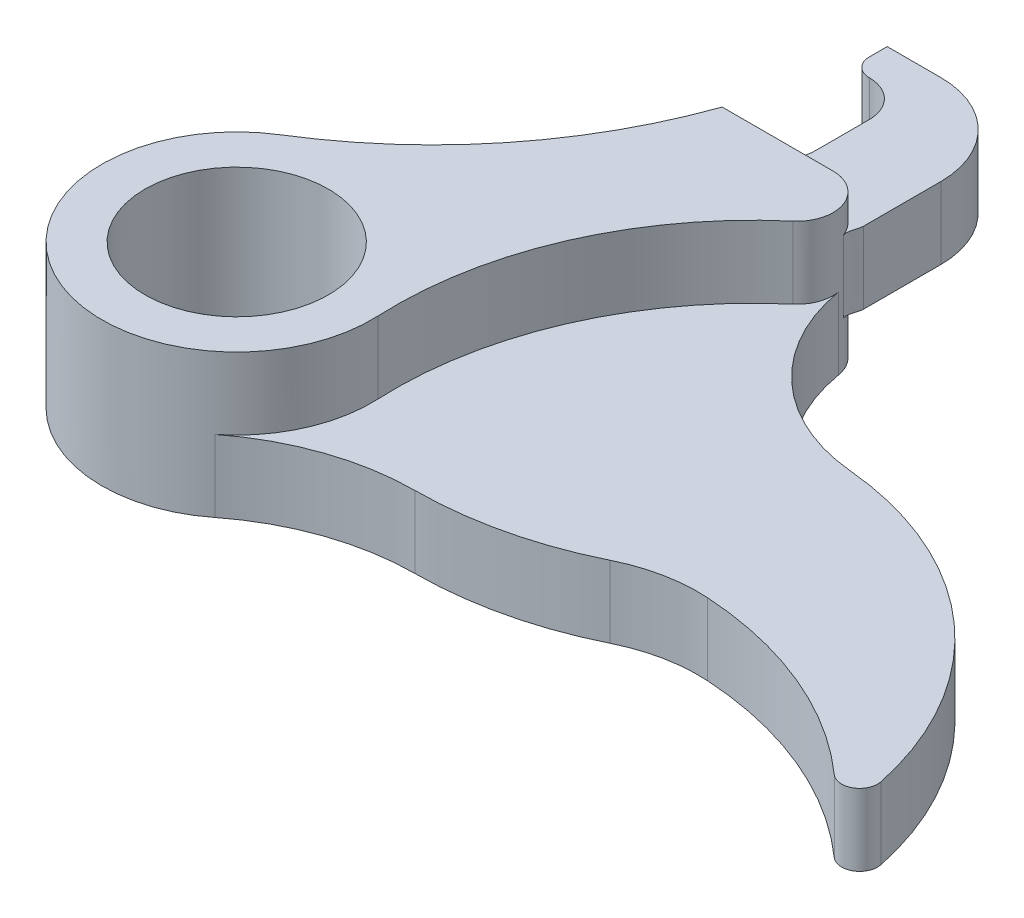
ISO-10303-21;
HEADER;
FILE_DESCRIPTION(('STEP AP214'),'2;1');
FILE_NAME('part.step','',(''),(''),'','','');
FILE_SCHEMA(('AUTOMOTIVE_DESIGN { 1 0 10303 214 1 1 1 1 }'));
ENDSEC;
DATA;
#1=APPLICATION_CONTEXT('core data for automotive mechanical design processes');
#2=APPLICATION_PROTOCOL_DEFINITION('international standard','automotive_design',2000,#1);
#3=PRODUCT_CONTEXT('',#1,'mechanical');
#4=PRODUCT('Part','Part','',(#3));
#5=PRODUCT_RELATED_PRODUCT_CATEGORY('part','',(#4));
#6=PRODUCT_DEFINITION_FORMATION('','',#4);
#7=PRODUCT_DEFINITION_CONTEXT('part definition',#1,'design');
#8=PRODUCT_DEFINITION('design','',#6,#7);
#9=PRODUCT_DEFINITION_SHAPE('','',#8);
#10=(LENGTH_UNIT() NAMED_UNIT(*) SI_UNIT(.MILLI.,.METRE.));
#11=(NAMED_UNIT(*) PLANE_ANGLE_UNIT() SI_UNIT($,.RADIAN.));
#12=(NAMED_UNIT(*) SI_UNIT($,.STERADIAN.) SOLID_ANGLE_UNIT());
#13=UNCERTAINTY_MEASURE_WITH_UNIT(LENGTH_MEASURE(1.E-05),#10,'distance_accuracy_value','');
#14=(GEOMETRIC_REPRESENTATION_CONTEXT(3) GLOBAL_UNCERTAINTY_ASSIGNED_CONTEXT((#13)) GLOBAL_UNIT_ASSIGNED_CONTEXT((#10,
#11,#12)) REPRESENTATION_CONTEXT('',''));
#15=CARTESIAN_POINT('',(0.,0.,0.));
#16=DIRECTION('',(0.,0.,1.));
#17=DIRECTION('',(1.,0.,0.));
#18=AXIS2_PLACEMENT_3D('',#15,#16,#17);
#19=CARTESIAN_POINT('',(-19.2617725904841,-2.40588798883223E-11,19.99756497));
#20=DIRECTION('',(-1.48435430613603E-12,1.,0.));
#21=DIRECTION('',(0.,0.,-1.));
#22=AXIS2_PLACEMENT_3D('',#19,#20,#21);
#23=CYLINDRICAL_SURFACE('',#22,7.5);
#24=CARTESIAN_POINT('',(-19.261772590496,7.99999999997594,19.99756497));
#25=DIRECTION('',(-1.48434665825187E-12,1.,0.));
#26=DIRECTION('',(-1.,-1.48434665825187E-12,0.));
#27=AXIS2_PLACEMENT_3D('',#24,#25,#26);
#28=CIRCLE('',#27,7.5);
#29=CARTESIAN_POINT('',(-23.218925607842,7.99999999997007,13.6264630247076));
#30=VERTEX_POINT('',#29);
#31=CARTESIAN_POINT('',(-11.7703780966913,7.99999999998703,19.638387384127));
#32=VERTEX_POINT('',#31);
#33=EDGE_CURVE('E58',#30,#32,#28,.T.);
#34=ORIENTED_EDGE('',*,*,#33,.F.);
#35=DIRECTION('',(-1.48435430613603E-12,1.,0.));
#36=VECTOR('',#35,1.);
#37=CARTESIAN_POINT('',(-23.2189256078302,-2.99326535779798E-11,13.6264630247076));
#38=LINE('',#37,#36);
#39=CARTESIAN_POINT('',(-23.2189256078302,-2.99326535779798E-11,13.6264630247076));
#40=VERTEX_POINT('',#39);
#41=EDGE_CURVE('E244',#40,#30,#38,.T.);
#42=ORIENTED_EDGE('',*,*,#41,.F.);
#43=CARTESIAN_POINT('',(-19.2617725904841,-2.40588798883223E-11,19.99756497));
#44=DIRECTION('',(1.48435430613603E-12,-1.,0.));
#45=DIRECTION('',(0.,0.,1.));
#46=AXIS2_PLACEMENT_3D('',#43,#44,#45);
#47=CIRCLE('',#46,7.5);
#48=CARTESIAN_POINT('',(-14.6040847929946,-1.71451394748168E-11,25.8759954051687));
#49=VERTEX_POINT('',#48);
#50=EDGE_CURVE('E362',#49,#40,#47,.T.);
#51=ORIENTED_EDGE('',*,*,#50,.F.);
#52=DIRECTION('',(-1.48435430613603E-12,1.,0.));
#53=VECTOR('',#52,1.);
#54=CARTESIAN_POINT('',(-14.6040847929946,-1.71451394748168E-11,25.8759954051687));
#55=LINE('',#54,#53);
#56=CARTESIAN_POINT('',(-14.6040847930006,3.99999999998286,25.8759954051687));
#57=VERTEX_POINT('',#56);
#58=EDGE_CURVE('E248',#49,#57,#55,.T.);
#59=ORIENTED_EDGE('',*,*,#58,.T.);
#60=CARTESIAN_POINT('',(-19.26177259049,3.99999999997594,19.99756497));
#61=DIRECTION('',(-1.48434665825187E-12,1.,0.));
#62=DIRECTION('',(-1.,-1.48434665825187E-12,0.));
#63=AXIS2_PLACEMENT_3D('',#60,#61,#62);
#64=CIRCLE('',#63,7.5);
#65=CARTESIAN_POINT('',(-11.7703780966854,3.99999999998706,19.638387384127));
#66=VERTEX_POINT('',#65);
#67=EDGE_CURVE('E11',#57,#66,#64,.T.);
#68=ORIENTED_EDGE('',*,*,#67,.T.);
#69=DIRECTION('',(1.48435430613603E-12,-1.,0.));
#70=VECTOR('',#69,1.);
#71=CARTESIAN_POINT('',(-11.7703780966928,8.99999999998706,19.638387384127));
#72=LINE('',#71,#70);
#73=EDGE_CURVE('E300',#32,#66,#72,.T.);
#74=ORIENTED_EDGE('',*,*,#73,.F.);
#75=EDGE_LOOP('',(#34,#42,#51,#59,#68,#74));
#76=FACE_BOUND('',#75,.T.);
#77=ADVANCED_FACE('F41',(#76),#23,.T.);
#78=CARTESIAN_POINT('',(-37.1392832705067,-5.05949449003396E-11,-8.78561388894304));
#79=DIRECTION('',(-1.48435430613603E-12,1.,0.));
#80=DIRECTION('',(0.,0.,-1.));
#81=AXIS2_PLACEMENT_3D('',#78,#79,#80);
#82=CYLINDRICAL_SURFACE('',#81,26.38328162);
#83=ORIENTED_EDGE('',*,*,#41,.T.);
#84=CARTESIAN_POINT('',(-37.1392832705186,7.9999999999494,-8.78561388894304));
#85=DIRECTION('',(1.48434665825187E-12,-1.,0.));
#86=DIRECTION('',(-1.,-1.48434665825187E-12,0.));
#87=AXIS2_PLACEMENT_3D('',#84,#85,#86);
#88=CIRCLE('',#87,26.38328162);
#89=CARTESIAN_POINT('',(-12.261772590496,7.99999999998633,0.));
#90=VERTEX_POINT('',#89);
#91=EDGE_CURVE('E226',#90,#30,#88,.T.);
#92=ORIENTED_EDGE('',*,*,#91,.F.);
#93=DIRECTION('',(-1.48435430613603E-12,1.,0.));
#94=VECTOR('',#93,1.);
#95=CARTESIAN_POINT('',(-12.2617725904841,-1.36678862672213E-11,0.));
#96=LINE('',#95,#94);
#97=CARTESIAN_POINT('',(-12.2617725904841,-1.36678862672213E-11,0.));
#98=VERTEX_POINT('',#97);
#99=EDGE_CURVE('E224',#98,#90,#96,.T.);
#100=ORIENTED_EDGE('',*,*,#99,.F.);
#101=CARTESIAN_POINT('',(-37.1392832705067,-5.05949449003396E-11,-8.78561388894304));
#102=DIRECTION('',(1.48435430613603E-12,-1.,0.));
#103=DIRECTION('',(0.,0.,1.));
#104=AXIS2_PLACEMENT_3D('',#101,#102,#103);
#105=CIRCLE('',#104,26.38328162);
#106=EDGE_CURVE('E365',#98,#40,#105,.T.);
#107=ORIENTED_EDGE('',*,*,#106,.T.);
#108=EDGE_LOOP('',(#83,#92,#100,#107));
#109=FACE_BOUND('',#108,.T.);
#110=ADVANCED_FACE('F528',(#109),#82,.F.);
#111=CARTESIAN_POINT('',(-6.09400259048409,-4.51288312275366E-12,0.));
#112=DIRECTION('',(0.,0.,-1.));
#113=DIRECTION('',(1.,1.48435430613603E-12,0.));
#114=AXIS2_PLACEMENT_3D('',#111,#112,#113);
#115=PLANE('',#114);
#116=ORIENTED_EDGE('',*,*,#99,.T.);
#117=DIRECTION('',(-1.,-1.48447015796723E-12,0.));
#118=VECTOR('',#117,1.);
#119=CARTESIAN_POINT('',(-6.09400259049595,7.99999999999549,0.));
#120=LINE('',#119,#118);
#121=CARTESIAN_POINT('',(-6.09400259049595,7.99999999999549,0.));
#122=VERTEX_POINT('',#121);
#123=EDGE_CURVE('E212',#122,#90,#120,.T.);
#124=ORIENTED_EDGE('',*,*,#123,.F.);
#125=DIRECTION('',(-1.48435430613603E-12,1.,0.));
#126=VECTOR('',#125,1.);
#127=CARTESIAN_POINT('',(-6.09400259048409,-4.51288312275366E-12,0.));
#128=LINE('',#127,#126);
#129=CARTESIAN_POINT('',(-6.09400259049374,6.49999999999252,0.));
#130=VERTEX_POINT('',#129);
#131=EDGE_CURVE('E222',#130,#122,#128,.T.);
#132=ORIENTED_EDGE('',*,*,#131,.F.);
#133=DIRECTION('',(1.,1.48437513593599E-12,0.));
#134=VECTOR('',#133,1.);
#135=CARTESIAN_POINT('',(-9.64838907610657E-12,6.50000000000453,0.));
#136=LINE('',#135,#134);
#137=CARTESIAN_POINT('',(-11.0690259589157,6.4999999999881,0.));
#138=VERTEX_POINT('',#137);
#139=EDGE_CURVE('E66',#138,#130,#136,.T.);
#140=ORIENTED_EDGE('',*,*,#139,.F.);
#141=DIRECTION('',(1.48435048219395E-12,-1.,0.));
#142=VECTOR('',#141,1.);
#143=CARTESIAN_POINT('',(-11.0690259589158,6.4999999999881,0.));
#144=LINE('',#143,#142);
#145=CARTESIAN_POINT('',(-11.0690259589098,2.4999999999881,0.));
#146=VERTEX_POINT('',#145);
#147=EDGE_CURVE('E417',#138,#146,#144,.T.);
#148=ORIENTED_EDGE('',*,*,#147,.T.);
#149=DIRECTION('',(1.,1.48437513593599E-12,0.));
#150=VECTOR('',#149,1.);
#151=CARTESIAN_POINT('',(-3.71098714733077E-12,2.50000000000453,0.));
#152=LINE('',#151,#150);
#153=CARTESIAN_POINT('',(-6.09400259048777,2.49999999999549,0.));
#154=VERTEX_POINT('',#153);
#155=EDGE_CURVE('E420',#146,#154,#152,.T.);
#156=ORIENTED_EDGE('',*,*,#155,.T.);
#157=CARTESIAN_POINT('',(-6.09400259048409,-4.51288312275366E-12,0.));
#158=VERTEX_POINT('',#157);
#159=EDGE_CURVE('E232',#158,#154,#128,.T.);
#160=ORIENTED_EDGE('',*,*,#159,.F.);
#161=DIRECTION('',(-1.,-1.48435430613603E-12,0.));
#162=VECTOR('',#161,1.);
#163=CARTESIAN_POINT('',(-6.09400259048409,-4.51288312275366E-12,0.));
#164=LINE('',#163,#162);
#165=EDGE_CURVE('E368',#158,#98,#164,.T.);
#166=ORIENTED_EDGE('',*,*,#165,.T.);
#167=EDGE_LOOP('',(#116,#124,#132,#140,#148,#156,#160,#166));
#168=FACE_BOUND('',#167,.T.);
#169=ADVANCED_FACE('F221',(#168),#115,.T.);
#170=CARTESIAN_POINT('',(-19.2617725904841,-2.40588798883223E-11,19.99756497));
#171=DIRECTION('',(-1.48435430613603E-12,1.,0.));
#172=DIRECTION('',(0.,0.,-1.));
#173=AXIS2_PLACEMENT_3D('',#170,#171,#172);
#174=CYLINDRICAL_SURFACE('',#173,5.100395);
#175=CARTESIAN_POINT('',(-19.2617725904841,-2.40588798883223E-11,19.99756497));
#176=DIRECTION('',(1.48435430613603E-12,-1.,0.));
#177=DIRECTION('',(0.,0.,1.));
#178=AXIS2_PLACEMENT_3D('',#175,#176,#177);
#179=CIRCLE('',#178,5.100395);
#180=CARTESIAN_POINT('',(-19.2617725904841,-2.40588798883223E-11,25.09795997));
#181=VERTEX_POINT('',#180);
#182=EDGE_CURVE('E324',#181,#181,#179,.T.);
#183=ORIENTED_EDGE('',*,*,#182,.T.);
#184=EDGE_LOOP('',(#183));
#185=FACE_BOUND('',#184,.T.);
#186=CARTESIAN_POINT('',(-19.261772590496,7.99999999997594,19.99756497));
#187=DIRECTION('',(-1.48434665825187E-12,1.,0.));
#188=DIRECTION('',(-1.,-1.48434665825187E-12,0.));
#189=AXIS2_PLACEMENT_3D('',#186,#187,#188);
#190=CIRCLE('',#189,5.100395);
#191=CARTESIAN_POINT('',(-24.362167590496,7.99999999996837,19.99756497));
#192=VERTEX_POINT('',#191);
#193=EDGE_CURVE('E466',#192,#192,#190,.T.);
#194=ORIENTED_EDGE('',*,*,#193,.T.);
#195=EDGE_LOOP('',(#194));
#196=FACE_BOUND('',#195,.T.);
#197=ADVANCED_FACE('F43',(#185,#196),#174,.F.);
#198=CARTESIAN_POINT('',(-6.09400259048409,-4.51288312275366E-12,2.));
#199=DIRECTION('',(-1.48435430613603E-12,1.,0.));
#200=DIRECTION('',(0.,0.,-1.));
#201=AXIS2_PLACEMENT_3D('',#198,#199,#200);
#202=CYLINDRICAL_SURFACE('',#201,2.);
#203=CARTESIAN_POINT('',(-6.09400259049597,7.99999999999549,2.));
#204=DIRECTION('',(-1.48434665825187E-12,1.,0.));
#205=DIRECTION('',(-1.,-1.48434665825187E-12,0.));
#206=AXIS2_PLACEMENT_3D('',#203,#204,#205);
#207=CIRCLE('',#206,2.);
#208=CARTESIAN_POINT('',(-4.79627450492435,7.99999999999742,3.52180873171323));
#209=VERTEX_POINT('',#208);
#210=EDGE_CURVE('E209',#209,#122,#207,.T.);
#211=ORIENTED_EDGE('',*,*,#210,.F.);
#212=DIRECTION('',(1.48435430613603E-12,-1.,0.));
#213=VECTOR('',#212,1.);
#214=CARTESIAN_POINT('',(-4.79627450492583,8.99999999999742,3.52180873171323));
#215=LINE('',#214,#213);
#216=CARTESIAN_POINT('',(-4.79627450491841,3.99999999999741,3.52180873171323));
#217=VERTEX_POINT('',#216);
#218=EDGE_CURVE('E297',#209,#217,#215,.T.);
#219=ORIENTED_EDGE('',*,*,#218,.T.);
#220=CARTESIAN_POINT('',(-6.09400259049003,3.99999999999549,2.));
#221=DIRECTION('',(-1.48434665825187E-12,1.,0.));
#222=DIRECTION('',(-1.,-1.48434665825187E-12,0.));
#223=AXIS2_PLACEMENT_3D('',#220,#221,#222);
#224=CIRCLE('',#223,2.);
#225=CARTESIAN_POINT('',(-4.12197599612349,3.99999999999842,1.66666666666667));
#226=VERTEX_POINT('',#225);
#227=EDGE_CURVE('E376',#217,#226,#224,.T.);
#228=ORIENTED_EDGE('',*,*,#227,.T.);
#229=DIRECTION('',(-1.48435430613603E-12,1.,0.));
#230=VECTOR('',#229,1.);
#231=CARTESIAN_POINT('',(-4.12197599611755,-1.5855372570428E-12,1.66666666666667));
#232=LINE('',#231,#230);
#233=CARTESIAN_POINT('',(-4.12197599611755,-1.5855372570428E-12,1.66666666666667));
#234=VERTEX_POINT('',#233);
#235=EDGE_CURVE('E233',#234,#226,#232,.T.);
#236=ORIENTED_EDGE('',*,*,#235,.F.);
#237=CARTESIAN_POINT('',(-6.09400259048409,-4.51288312275366E-12,2.));
#238=DIRECTION('',(1.48435430613603E-12,-1.,0.));
#239=DIRECTION('',(0.,0.,1.));
#240=AXIS2_PLACEMENT_3D('',#237,#238,#239);
#241=CIRCLE('',#240,2.);
#242=EDGE_CURVE('E238',#158,#234,#241,.T.);
#243=ORIENTED_EDGE('',*,*,#242,.F.);
#244=ORIENTED_EDGE('',*,*,#159,.T.);
#245=CARTESIAN_POINT('',(-6.0940025904878,2.49999999999549,2.));
#246=DIRECTION('',(-1.48437513593599E-12,1.,0.));
#247=DIRECTION('',(-1.,-1.48437513593599E-12,0.));
#248=AXIS2_PLACEMENT_3D('',#245,#246,#247);
#249=CIRCLE('',#248,2.);
#250=CARTESIAN_POINT('',(-4.22232179268239,2.49999999999827,1.29515179568469));
#251=VERTEX_POINT('',#250);
#252=EDGE_CURVE('E459',#251,#154,#249,.T.);
#253=ORIENTED_EDGE('',*,*,#252,.F.);
#254=DIRECTION('',(1.48435048219395E-12,-1.,0.));
#255=VECTOR('',#254,1.);
#256=CARTESIAN_POINT('',(-4.22232179268833,6.49999999999827,1.29515179568469));
#257=LINE('',#256,#255);
#258=CARTESIAN_POINT('',(-4.22232179268834,6.49999999999827,1.29515179568467));
#259=VERTEX_POINT('',#258);
#260=EDGE_CURVE('E384',#259,#251,#257,.T.);
#261=ORIENTED_EDGE('',*,*,#260,.F.);
#262=CARTESIAN_POINT('',(-6.09400259049374,6.49999999999549,2.));
#263=DIRECTION('',(-1.48437513593599E-12,1.,0.));
#264=DIRECTION('',(-1.,-1.48437513593599E-12,0.));
#265=AXIS2_PLACEMENT_3D('',#262,#263,#264);
#266=CIRCLE('',#265,2.);
#267=EDGE_CURVE('E230',#259,#130,#266,.T.);
#268=ORIENTED_EDGE('',*,*,#267,.T.);
#269=ORIENTED_EDGE('',*,*,#131,.T.);
#270=EDGE_LOOP('',(#211,#219,#228,#236,#243,#244,#253,#261,#268,#269));
#271=FACE_BOUND('',#270,.T.);
#272=ADVANCED_FACE('F228',(#271),#202,.T.);
#273=CARTESIAN_POINT('',(8.13341982011469,9.00000000001661,18.6840926808679));
#274=DIRECTION('',(1.48435430613603E-12,-1.,0.));
#275=DIRECTION('',(1.,1.48435430613603E-12,0.));
#276=AXIS2_PLACEMENT_3D('',#273,#274,#275);
#277=CYLINDRICAL_SURFACE('',#276,19.926661785);
#278=ORIENTED_EDGE('',*,*,#218,.F.);
#279=CARTESIAN_POINT('',(8.13341982011617,8.00000000001661,18.6840926808679));
#280=DIRECTION('',(1.48434665825187E-12,-1.,0.));
#281=DIRECTION('',(-1.,-1.48434665825187E-12,0.));
#282=AXIS2_PLACEMENT_3D('',#279,#280,#281);
#283=CIRCLE('',#282,19.926661785);
#284=EDGE_CURVE('E214',#32,#209,#283,.T.);
#285=ORIENTED_EDGE('',*,*,#284,.F.);
#286=ORIENTED_EDGE('',*,*,#73,.T.);
#287=CARTESIAN_POINT('',(8.13341982012211,4.00000000001661,18.6840926808679));
#288=DIRECTION('',(-1.48434665825187E-12,1.,0.));
#289=DIRECTION('',(-1.,-1.48434665825187E-12,0.));
#290=AXIS2_PLACEMENT_3D('',#287,#288,#289);
#291=CIRCLE('',#290,19.926661785);
#292=EDGE_CURVE('E380',#217,#66,#291,.T.);
#293=ORIENTED_EDGE('',*,*,#292,.F.);
#294=EDGE_LOOP('',(#278,#285,#286,#293));
#295=FACE_BOUND('',#294,.T.);
#296=ADVANCED_FACE('F514',(#295),#277,.F.);
#297=CARTESIAN_POINT('',(-6.09400259049003,3.99999999999549,0.));
#298=DIRECTION('',(1.48435430613603E-12,-1.,0.));
#299=DIRECTION('',(0.,0.,1.));
#300=AXIS2_PLACEMENT_3D('',#297,#298,#299);
#301=PLANE('',#300);
#302=ORIENTED_EDGE('',*,*,#67,.F.);
#303=CARTESIAN_POINT('',(3.16235740950997,4.00000000000923,27.7451908777858));
#304=DIRECTION('',(1.48435430613603E-12,-1.,0.));
#305=DIRECTION('',(0.,0.,1.));
#306=AXIS2_PLACEMENT_3D('',#303,#304,#305);
#307=CIRCLE('',#306,17.8645);
#308=CARTESIAN_POINT('',(-14.6040983176473,3.99999999998286,25.8761239595189));
#309=VERTEX_POINT('',#308);
#310=EDGE_CURVE('E321',#309,#57,#307,.T.);
#311=ORIENTED_EDGE('',*,*,#310,.F.);
#312=CARTESIAN_POINT('',(-6.2868095675778,3.9999999999952,36.5081119378406));
#313=DIRECTION('',(1.48435430613603E-12,-1.,0.));
#314=DIRECTION('',(0.,0.,1.));
#315=AXIS2_PLACEMENT_3D('',#312,#313,#314);
#316=CIRCLE('',#315,13.49875774);
#317=CARTESIAN_POINT('',(-6.33412677828531,3.99999999999513,23.0094371286313));
#318=VERTEX_POINT('',#317);
#319=EDGE_CURVE('E318',#309,#318,#316,.T.);
#320=ORIENTED_EDGE('',*,*,#319,.T.);
#321=CARTESIAN_POINT('',(-6.40423259049003,3.99999999999503,3.00962));
#322=DIRECTION('',(1.48435430613603E-12,-1.,0.));
#323=DIRECTION('',(0.,0.,1.));
#324=AXIS2_PLACEMENT_3D('',#321,#322,#323);
#325=CIRCLE('',#324,19.99994);
#326=CARTESIAN_POINT('',(2.44004222061369,4.00000000000816,20.947747078078));
#327=VERTEX_POINT('',#326);
#328=EDGE_CURVE('E314',#327,#318,#325,.T.);
#329=ORIENTED_EDGE('',*,*,#328,.F.);
#330=CARTESIAN_POINT('',(6.41586472558919,4.00000000001406,29.0115862121351));
#331=DIRECTION('',(1.48435430613603E-12,-1.,0.));
#332=DIRECTION('',(0.,0.,1.));
#333=AXIS2_PLACEMENT_3D('',#330,#331,#332);
#334=CIRCLE('',#333,8.99069886999999);
#335=CARTESIAN_POINT('',(6.96922822443385,4.00000000001488,20.0379328307543));
#336=VERTEX_POINT('',#335);
#337=EDGE_CURVE('E310',#327,#336,#334,.T.);
#338=ORIENTED_EDGE('',*,*,#337,.T.);
#339=CARTESIAN_POINT('',(5.73826555950997,4.00000000001305,39.99991497));
#340=DIRECTION('',(1.48435430613603E-12,-1.,0.));
#341=DIRECTION('',(0.,0.,1.));
#342=AXIS2_PLACEMENT_3D('',#339,#340,#341);
#343=CIRCLE('',#342,19.9999);
#344=CARTESIAN_POINT('',(19.0036268804299,4.00000000003274,25.0324105342084));
#345=VERTEX_POINT('',#344);
#346=EDGE_CURVE('E307',#336,#345,#343,.T.);
#347=ORIENTED_EDGE('',*,*,#346,.T.);
#348=CARTESIAN_POINT('',(19.667245889997,4.00000000003373,24.2836393376253));
#349=DIRECTION('',(1.48435430613603E-12,-1.,0.));
#350=DIRECTION('',(0.,0.,1.));
#351=AXIS2_PLACEMENT_3D('',#348,#349,#350);
#352=CIRCLE('',#351,1.00052411);
#353=CARTESIAN_POINT('',(20.6464656757286,4.00000000003518,24.0782686826547));
#354=VERTEX_POINT('',#353);
#355=EDGE_CURVE('E291',#354,#345,#352,.T.);
#356=ORIENTED_EDGE('',*,*,#355,.F.);
#357=CARTESIAN_POINT('',(3.16235740950997,4.00000000000923,27.7451908777858));
#358=DIRECTION('',(1.48435430613603E-12,-1.,0.));
#359=DIRECTION('',(0.,0.,1.));
#360=AXIS2_PLACEMENT_3D('',#357,#358,#359);
#361=CIRCLE('',#360,17.8645);
#362=CARTESIAN_POINT('',(4.81375511448821,4.00000000001168,9.95718239257327));
#363=VERTEX_POINT('',#362);
#364=EDGE_CURVE('E278',#363,#354,#361,.T.);
#365=ORIENTED_EDGE('',*,*,#364,.F.);
#366=CARTESIAN_POINT('',(5.73815697570921,4.00000000001305,0.));
#367=DIRECTION('',(1.48435430613603E-12,-1.,0.));
#368=DIRECTION('',(0.,0.,1.));
#369=AXIS2_PLACEMENT_3D('',#366,#367,#368);
#370=CIRCLE('',#369,10.);
#371=EDGE_CURVE('E289',#363,#226,#370,.T.);
#372=ORIENTED_EDGE('',*,*,#371,.T.);
#373=ORIENTED_EDGE('',*,*,#227,.F.);
#374=ORIENTED_EDGE('',*,*,#292,.T.);
#375=EDGE_LOOP('',(#302,#311,#320,#329,#338,#347,#356,#365,#372,#373,#374));
#376=FACE_BOUND('',#375,.T.);
#377=ADVANCED_FACE('F287',(#376),#301,.F.);
#378=CARTESIAN_POINT('',(5.73815697571515,1.30503247097735E-11,0.));
#379=DIRECTION('',(-1.48435430613603E-12,1.,0.));
#380=DIRECTION('',(0.,0.,-1.));
#381=AXIS2_PLACEMENT_3D('',#378,#379,#380);
#382=CYLINDRICAL_SURFACE('',#381,10.);
#383=ORIENTED_EDGE('',*,*,#371,.F.);
#384=DIRECTION('',(-1.48435430613603E-12,1.,0.));
#385=VECTOR('',#384,1.);
#386=CARTESIAN_POINT('',(4.81375511449415,1.16781584402759E-11,9.95718239257327));
#387=LINE('',#386,#385);
#388=CARTESIAN_POINT('',(4.81375511449415,1.16781584402759E-11,9.95718239257327));
#389=VERTEX_POINT('',#388);
#390=EDGE_CURVE('E45',#389,#363,#387,.T.);
#391=ORIENTED_EDGE('',*,*,#390,.F.);
#392=CARTESIAN_POINT('',(5.73815697571515,1.30503247097735E-11,0.));
#393=DIRECTION('',(1.48435430613603E-12,-1.,0.));
#394=DIRECTION('',(0.,0.,1.));
#395=AXIS2_PLACEMENT_3D('',#392,#393,#394);
#396=CIRCLE('',#395,10.);
#397=EDGE_CURVE('E330',#389,#234,#396,.T.);
#398=ORIENTED_EDGE('',*,*,#397,.T.);
#399=ORIENTED_EDGE('',*,*,#235,.T.);
#400=EDGE_LOOP('',(#383,#391,#398,#399));
#401=FACE_BOUND('',#400,.T.);
#402=ADVANCED_FACE('F294',(#401),#382,.F.);
#403=CARTESIAN_POINT('',(3.16235740951591,9.22699416872064E-12,27.7451908777858));
#404=DIRECTION('',(-1.48435430613603E-12,1.,0.));
#405=DIRECTION('',(0.,0.,-1.));
#406=AXIS2_PLACEMENT_3D('',#403,#404,#405);
#407=CYLINDRICAL_SURFACE('',#406,17.8645);
#408=ORIENTED_EDGE('',*,*,#364,.T.);
#409=DIRECTION('',(-1.48435430613603E-12,1.,0.));
#410=VECTOR('',#409,1.);
#411=CARTESIAN_POINT('',(20.6464656757346,3.51793247310717E-11,24.0782686826547));
#412=LINE('',#411,#410);
#413=CARTESIAN_POINT('',(20.6464656757346,3.51793247310717E-11,24.0782686826547));
#414=VERTEX_POINT('',#413);
#415=EDGE_CURVE('E266',#414,#354,#412,.T.);
#416=ORIENTED_EDGE('',*,*,#415,.F.);
#417=CARTESIAN_POINT('',(3.16235740951591,9.22699416872064E-12,27.7451908777858));
#418=DIRECTION('',(1.48435430613603E-12,-1.,0.));
#419=DIRECTION('',(0.,0.,1.));
#420=AXIS2_PLACEMENT_3D('',#417,#418,#419);
#421=CIRCLE('',#420,17.8645);
#422=EDGE_CURVE('E280',#389,#414,#421,.T.);
#423=ORIENTED_EDGE('',*,*,#422,.F.);
#424=ORIENTED_EDGE('',*,*,#390,.T.);
#425=EDGE_LOOP('',(#408,#416,#423,#424));
#426=FACE_BOUND('',#425,.T.);
#427=ADVANCED_FACE('F277',(#426),#407,.T.);
#428=CARTESIAN_POINT('',(19.667245890003,3.37256264582031E-11,24.2836393376253));
#429=DIRECTION('',(-1.48435430613603E-12,1.,0.));
#430=DIRECTION('',(0.,0.,-1.));
#431=AXIS2_PLACEMENT_3D('',#428,#429,#430);
#432=CYLINDRICAL_SURFACE('',#431,1.00052411);
#433=ORIENTED_EDGE('',*,*,#355,.T.);
#434=DIRECTION('',(-1.48435430613603E-12,1.,0.));
#435=VECTOR('',#434,1.);
#436=CARTESIAN_POINT('',(19.0036268804358,3.27411708855863E-11,25.0324105342084));
#437=LINE('',#436,#435);
#438=CARTESIAN_POINT('',(19.0036268804358,3.27411708855863E-11,25.0324105342084));
#439=VERTEX_POINT('',#438);
#440=EDGE_CURVE('E264',#439,#345,#437,.T.);
#441=ORIENTED_EDGE('',*,*,#440,.F.);
#442=CARTESIAN_POINT('',(19.667245890003,3.37256264582031E-11,24.2836393376253));
#443=DIRECTION('',(1.48435430613603E-12,-1.,0.));
#444=DIRECTION('',(0.,0.,1.));
#445=AXIS2_PLACEMENT_3D('',#442,#443,#444);
#446=CIRCLE('',#445,1.00052411);
#447=EDGE_CURVE('E340',#414,#439,#446,.T.);
#448=ORIENTED_EDGE('',*,*,#447,.F.);
#449=ORIENTED_EDGE('',*,*,#415,.T.);
#450=EDGE_LOOP('',(#433,#441,#448,#449));
#451=FACE_BOUND('',#450,.T.);
#452=ADVANCED_FACE('F552',(#451),#432,.T.);
#453=CARTESIAN_POINT('',(5.73826555951591,1.30503247097735E-11,39.99991497));
#454=DIRECTION('',(-1.48435430613603E-12,1.,0.));
#455=DIRECTION('',(0.,0.,-1.));
#456=AXIS2_PLACEMENT_3D('',#453,#454,#455);
#457=CYLINDRICAL_SURFACE('',#456,19.9999);
#458=ORIENTED_EDGE('',*,*,#346,.F.);
#459=DIRECTION('',(-1.48435430613603E-12,1.,0.));
#460=VECTOR('',#459,1.);
#461=CARTESIAN_POINT('',(6.96922822443979,1.48778558917151E-11,20.0379328307543));
#462=LINE('',#461,#460);
#463=CARTESIAN_POINT('',(6.96922822443979,1.48778558917151E-11,20.0379328307543));
#464=VERTEX_POINT('',#463);
#465=EDGE_CURVE('E261',#464,#336,#462,.T.);
#466=ORIENTED_EDGE('',*,*,#465,.F.);
#467=CARTESIAN_POINT('',(5.73826555951591,1.30503247097735E-11,39.99991497));
#468=DIRECTION('',(1.48435430613603E-12,-1.,0.));
#469=DIRECTION('',(0.,0.,1.));
#470=AXIS2_PLACEMENT_3D('',#467,#468,#469);
#471=CIRCLE('',#470,19.9999);
#472=EDGE_CURVE('E343',#464,#439,#471,.T.);
#473=ORIENTED_EDGE('',*,*,#472,.T.);
#474=ORIENTED_EDGE('',*,*,#440,.T.);
#475=EDGE_LOOP('',(#458,#466,#473,#474));
#476=FACE_BOUND('',#475,.T.);
#477=ADVANCED_FACE('F548',(#476),#457,.F.);
#478=CARTESIAN_POINT('',(6.41586472559513,1.40564643258401E-11,29.0115862121351));
#479=DIRECTION('',(-1.48435430613603E-12,1.,0.));
#480=DIRECTION('',(0.,0.,-1.));
#481=AXIS2_PLACEMENT_3D('',#478,#479,#480);
#482=CYLINDRICAL_SURFACE('',#481,8.99069886999999);
#483=ORIENTED_EDGE('',*,*,#337,.F.);
#484=DIRECTION('',(-1.48435430613603E-12,1.,0.));
#485=VECTOR('',#484,1.);
#486=CARTESIAN_POINT('',(2.44004222061963,8.15493506056697E-12,20.947747078078));
#487=LINE('',#486,#485);
#488=CARTESIAN_POINT('',(2.44004222061963,8.15493506056697E-12,20.947747078078));
#489=VERTEX_POINT('',#488);
#490=EDGE_CURVE('E258',#489,#327,#487,.T.);
#491=ORIENTED_EDGE('',*,*,#490,.F.);
#492=CARTESIAN_POINT('',(6.41586472559513,1.40564643258401E-11,29.0115862121351));
#493=DIRECTION('',(1.48435430613603E-12,-1.,0.));
#494=DIRECTION('',(0.,0.,1.));
#495=AXIS2_PLACEMENT_3D('',#492,#493,#494);
#496=CIRCLE('',#495,8.99069886999999);
#497=EDGE_CURVE('E347',#489,#464,#496,.T.);
#498=ORIENTED_EDGE('',*,*,#497,.T.);
#499=ORIENTED_EDGE('',*,*,#465,.T.);
#500=EDGE_LOOP('',(#483,#491,#498,#499));
#501=FACE_BOUND('',#500,.T.);
#502=ADVANCED_FACE('F544',(#501),#482,.F.);
#503=CARTESIAN_POINT('',(-6.40423259048409,-4.97345220562551E-12,3.00962));
#504=DIRECTION('',(-1.48435430613603E-12,1.,0.));
#505=DIRECTION('',(0.,0.,-1.));
#506=AXIS2_PLACEMENT_3D('',#503,#504,#505);
#507=CYLINDRICAL_SURFACE('',#506,19.99994);
#508=ORIENTED_EDGE('',*,*,#328,.T.);
#509=DIRECTION('',(-1.48435430613603E-12,1.,0.));
#510=VECTOR('',#509,1.);
#511=CARTESIAN_POINT('',(-6.33412677827937,-4.8693687970669E-12,23.0094371286313));
#512=LINE('',#511,#510);
#513=CARTESIAN_POINT('',(-6.33412677827937,-4.8693687970669E-12,23.0094371286313));
#514=VERTEX_POINT('',#513);
#515=EDGE_CURVE('E255',#514,#318,#512,.T.);
#516=ORIENTED_EDGE('',*,*,#515,.F.);
#517=CARTESIAN_POINT('',(-6.40423259048409,-4.97345220562551E-12,3.00962));
#518=DIRECTION('',(1.48435430613603E-12,-1.,0.));
#519=DIRECTION('',(0.,0.,1.));
#520=AXIS2_PLACEMENT_3D('',#517,#518,#519);
#521=CIRCLE('',#520,19.99994);
#522=EDGE_CURVE('E351',#489,#514,#521,.T.);
#523=ORIENTED_EDGE('',*,*,#522,.F.);
#524=ORIENTED_EDGE('',*,*,#490,.T.);
#525=EDGE_LOOP('',(#508,#516,#523,#524));
#526=FACE_BOUND('',#525,.T.);
#527=ADVANCED_FACE('F540',(#526),#507,.T.);
#528=CARTESIAN_POINT('',(-6.28680956757186,-4.79911249628984E-12,36.5081119378406));
#529=DIRECTION('',(-1.48435430613603E-12,1.,0.));
#530=DIRECTION('',(0.,0.,-1.));
#531=AXIS2_PLACEMENT_3D('',#528,#529,#530);
#532=CYLINDRICAL_SURFACE('',#531,13.49875774);
#533=ORIENTED_EDGE('',*,*,#319,.F.);
#534=DIRECTION('',(-1.48435430613603E-12,1.,0.));
#535=VECTOR('',#534,1.);
#536=CARTESIAN_POINT('',(-14.6040983176414,-1.71451394748168E-11,25.8761239595189));
#537=LINE('',#536,#535);
#538=CARTESIAN_POINT('',(-14.6040983176414,-1.71451394748168E-11,25.8761239595189));
#539=VERTEX_POINT('',#538);
#540=EDGE_CURVE('E252',#539,#309,#537,.T.);
#541=ORIENTED_EDGE('',*,*,#540,.F.);
#542=CARTESIAN_POINT('',(-6.28680956757186,-4.79911249628984E-12,36.5081119378406));
#543=DIRECTION('',(1.48435430613603E-12,-1.,0.));
#544=DIRECTION('',(0.,0.,1.));
#545=AXIS2_PLACEMENT_3D('',#542,#543,#544);
#546=CIRCLE('',#545,13.49875774);
#547=EDGE_CURVE('E354',#539,#514,#546,.T.);
#548=ORIENTED_EDGE('',*,*,#547,.T.);
#549=ORIENTED_EDGE('',*,*,#515,.T.);
#550=EDGE_LOOP('',(#533,#541,#548,#549));
#551=FACE_BOUND('',#550,.T.);
#552=ADVANCED_FACE('F537',(#551),#532,.F.);
#553=CARTESIAN_POINT('',(3.16235740951591,9.22699416872064E-12,27.7451908777858));
#554=DIRECTION('',(-1.48435430613603E-12,1.,0.));
#555=DIRECTION('',(0.,0.,-1.));
#556=AXIS2_PLACEMENT_3D('',#553,#554,#555);
#557=CYLINDRICAL_SURFACE('',#556,17.8645);
#558=ORIENTED_EDGE('',*,*,#310,.T.);
#559=ORIENTED_EDGE('',*,*,#58,.F.);
#560=CARTESIAN_POINT('',(3.16235740951591,9.22699416872064E-12,27.7451908777858));
#561=DIRECTION('',(1.48435430613603E-12,-1.,0.));
#562=DIRECTION('',(0.,0.,1.));
#563=AXIS2_PLACEMENT_3D('',#560,#561,#562);
#564=CIRCLE('',#563,17.8645);
#565=EDGE_CURVE('E358',#539,#49,#564,.T.);
#566=ORIENTED_EDGE('',*,*,#565,.F.);
#567=ORIENTED_EDGE('',*,*,#540,.T.);
#568=EDGE_LOOP('',(#558,#559,#566,#567));
#569=FACE_BOUND('',#568,.T.);
#570=ADVANCED_FACE('F520',(#569),#557,.T.);
#571=CARTESIAN_POINT('',(-6.09400259048409,-4.51288312275366E-12,0.));
#572=DIRECTION('',(1.48435430613603E-12,-1.,0.));
#573=DIRECTION('',(0.,0.,1.));
#574=AXIS2_PLACEMENT_3D('',#571,#572,#573);
#575=PLANE('',#574);
#576=ORIENTED_EDGE('',*,*,#182,.F.);
#577=EDGE_LOOP('',(#576));
#578=FACE_BOUND('',#577,.T.);
#579=ORIENTED_EDGE('',*,*,#397,.F.);
#580=ORIENTED_EDGE('',*,*,#422,.T.);
#581=ORIENTED_EDGE('',*,*,#447,.T.);
#582=ORIENTED_EDGE('',*,*,#472,.F.);
#583=ORIENTED_EDGE('',*,*,#497,.F.);
#584=ORIENTED_EDGE('',*,*,#522,.T.);
#585=ORIENTED_EDGE('',*,*,#547,.F.);
#586=ORIENTED_EDGE('',*,*,#565,.T.);
#587=ORIENTED_EDGE('',*,*,#50,.T.);
#588=ORIENTED_EDGE('',*,*,#106,.F.);
#589=ORIENTED_EDGE('',*,*,#165,.F.);
#590=ORIENTED_EDGE('',*,*,#242,.T.);
#591=EDGE_LOOP('',(#579,#580,#581,#582,#583,#584,#585,#586,#587,#588,#589,#590));
#592=FACE_BOUND('',#591,.T.);
#593=ADVANCED_FACE('F374',(#578,#592),#575,.T.);
#594=CARTESIAN_POINT('',(-4.2069885962213,6.49999999999829,1.33729479750045));
#595=CARTESIAN_POINT('',(-4.35262682852594,6.49999999999807,0.976394086681153));
#596=CARTESIAN_POINT('',(-4.10815131033199,6.49999999999844,0.659399747440334));
#597=CARTESIAN_POINT('',(-4.09400259049374,6.49999999999846,0.30864753821528));
#598=B_SPLINE_CURVE_WITH_KNOTS('',3,(#594,#595,#596,#597),.UNSPECIFIED.,.F.,.F.,(4,4),(0.,1.),.UNSPECIFIED.);
#599=DIRECTION('',(1.48435048219395E-12,-1.,0.));
#600=VECTOR('',#599,1.);
#601=SURFACE_OF_LINEAR_EXTRUSION('',#598,#600);
#602=CARTESIAN_POINT('',(-4.20698859621536,2.49999999999829,1.33729479750045));
#603=CARTESIAN_POINT('',(-4.35262682852001,2.49999999999807,0.976394086681153));
#604=CARTESIAN_POINT('',(-4.10815131032605,2.49999999999844,0.659399747440334));
#605=CARTESIAN_POINT('',(-4.0940025904878,2.49999999999846,0.30864753821528));
#606=B_SPLINE_CURVE_WITH_KNOTS('',3,(#602,#603,#604,#605),.UNSPECIFIED.,.F.,.F.,(4,4),(0.,1.),.UNSPECIFIED.);
#607=CARTESIAN_POINT('',(-4.0940025904878,2.49999999999846,0.30864753821528));
#608=VERTEX_POINT('',#607);
#609=EDGE_CURVE('E454',#251,#608,#606,.T.);
#610=ORIENTED_EDGE('',*,*,#609,.T.);
#611=DIRECTION('',(1.48435048219395E-12,-1.,0.));
#612=VECTOR('',#611,1.);
#613=CARTESIAN_POINT('',(-4.09400259049374,6.49999999999846,0.30864753821528));
#614=LINE('',#613,#612);
#615=CARTESIAN_POINT('',(-4.09400259049374,6.49999999999846,0.30864753821528));
#616=VERTEX_POINT('',#615);
#617=EDGE_CURVE('E390',#616,#608,#614,.T.);
#618=ORIENTED_EDGE('',*,*,#617,.F.);
#619=EDGE_CURVE('E496',#259,#616,#598,.T.);
#620=ORIENTED_EDGE('',*,*,#619,.F.);
#621=ORIENTED_EDGE('',*,*,#260,.T.);
#622=EDGE_LOOP('',(#610,#618,#620,#621));
#623=FACE_BOUND('',#622,.T.);
#624=ADVANCED_FACE('F507',(#623),#601,.F.);
#625=CARTESIAN_POINT('',(-4.09400259049374,6.49999999999846,0.));
#626=DIRECTION('',(-1.,-1.48435048219395E-12,0.));
#627=DIRECTION('',(1.48435048219395E-12,-1.,0.));
#628=AXIS2_PLACEMENT_3D('',#625,#626,#627);
#629=PLANE('',#628);
#630=DIRECTION('',(0.,0.,-1.));
#631=VECTOR('',#630,1.);
#632=CARTESIAN_POINT('',(-4.0940025904878,2.49999999999846,0.));
#633=LINE('',#632,#631);
#634=CARTESIAN_POINT('',(-4.0940025904878,2.49999999999846,-3.9999986499999));
#635=VERTEX_POINT('',#634);
#636=EDGE_CURVE('E451',#608,#635,#633,.T.);
#637=ORIENTED_EDGE('',*,*,#636,.T.);
#638=DIRECTION('',(1.48435048219395E-12,-1.,0.));
#639=VECTOR('',#638,1.);
#640=CARTESIAN_POINT('',(-4.09400259049374,6.49999999999846,-3.9999986499999));
#641=LINE('',#640,#639);
#642=CARTESIAN_POINT('',(-4.09400259049374,6.49999999999846,-3.9999986499999));
#643=VERTEX_POINT('',#642);
#644=EDGE_CURVE('E394',#643,#635,#641,.T.);
#645=ORIENTED_EDGE('',*,*,#644,.F.);
#646=DIRECTION('',(0.,0.,-1.));
#647=VECTOR('',#646,1.);
#648=CARTESIAN_POINT('',(-4.09400259049374,6.49999999999846,0.));
#649=LINE('',#648,#647);
#650=EDGE_CURVE('E493',#616,#643,#649,.T.);
#651=ORIENTED_EDGE('',*,*,#650,.F.);
#652=ORIENTED_EDGE('',*,*,#617,.T.);
#653=EDGE_LOOP('',(#637,#645,#651,#652));
#654=FACE_BOUND('',#653,.T.);
#655=ADVANCED_FACE('F511',(#654),#629,.F.);
#656=CARTESIAN_POINT('',(-9.09400169049384,6.49999999999103,-3.9999986499999));
#657=DIRECTION('',(1.48435048219395E-12,-1.,0.));
#658=DIRECTION('',(1.,1.48435048219395E-12,0.));
#659=AXIS2_PLACEMENT_3D('',#656,#657,#658);
#660=CYLINDRICAL_SURFACE('',#659,4.9999991000001);
#661=CARTESIAN_POINT('',(-9.0940016904879,2.49999999999103,-3.9999986499999));
#662=DIRECTION('',(-1.48437513593599E-12,1.,0.));
#663=DIRECTION('',(-1.,-1.48437513593599E-12,0.));
#664=AXIS2_PLACEMENT_3D('',#661,#662,#663);
#665=CIRCLE('',#664,4.9999991000001);
#666=CARTESIAN_POINT('',(-9.09400169048788,2.49999999999103,-8.99999775));
#667=VERTEX_POINT('',#666);
#668=EDGE_CURVE('E447',#635,#667,#665,.T.);
#669=ORIENTED_EDGE('',*,*,#668,.T.);
#670=DIRECTION('',(1.48435048219395E-12,-1.,0.));
#671=VECTOR('',#670,1.);
#672=CARTESIAN_POINT('',(-9.09400169049382,6.49999999999103,-8.99999775));
#673=LINE('',#672,#671);
#674=CARTESIAN_POINT('',(-9.09400169049382,6.49999999999103,-8.99999775));
#675=VERTEX_POINT('',#674);
#676=EDGE_CURVE('E398',#675,#667,#673,.T.);
#677=ORIENTED_EDGE('',*,*,#676,.F.);
#678=CARTESIAN_POINT('',(-9.09400169049384,6.49999999999103,-3.9999986499999));
#679=DIRECTION('',(-1.48437513593599E-12,1.,0.));
#680=DIRECTION('',(-1.,-1.48437513593599E-12,0.));
#681=AXIS2_PLACEMENT_3D('',#678,#679,#680);
#682=CIRCLE('',#681,4.9999991000001);
#683=EDGE_CURVE('E490',#643,#675,#682,.T.);
#684=ORIENTED_EDGE('',*,*,#683,.F.);
#685=ORIENTED_EDGE('',*,*,#644,.T.);
#686=EDGE_LOOP('',(#669,#677,#684,#685));
#687=FACE_BOUND('',#686,.T.);
#688=ADVANCED_FACE('F586',(#687),#660,.T.);
#689=CARTESIAN_POINT('',(-9.64838907610657E-12,6.50000000000453,-8.99999775));
#690=DIRECTION('',(0.,0.,-1.));
#691=DIRECTION('',(0.,1.,0.));
#692=AXIS2_PLACEMENT_3D('',#689,#690,#691);
#693=PLANE('',#692);
#694=DIRECTION('',(1.,1.48437513593599E-12,0.));
#695=VECTOR('',#694,1.);
#696=CARTESIAN_POINT('',(-3.71098714733077E-12,2.50000000000453,-8.99999775));
#697=LINE('',#696,#695);
#698=CARTESIAN_POINT('',(-12.0846869504878,2.4999999999866,-8.99999775));
#699=VERTEX_POINT('',#698);
#700=EDGE_CURVE('E443',#699,#667,#697,.T.);
#701=ORIENTED_EDGE('',*,*,#700,.F.);
#702=DIRECTION('',(1.48435048219395E-12,-1.,0.));
#703=VECTOR('',#702,1.);
#704=CARTESIAN_POINT('',(-12.0846869504938,6.4999999999866,-8.99999775));
#705=LINE('',#704,#703);
#706=CARTESIAN_POINT('',(-12.0846869504938,6.4999999999866,-8.99999775));
#707=VERTEX_POINT('',#706);
#708=EDGE_CURVE('E401',#707,#699,#705,.T.);
#709=ORIENTED_EDGE('',*,*,#708,.F.);
#710=DIRECTION('',(1.,1.48437513593599E-12,0.));
#711=VECTOR('',#710,1.);
#712=CARTESIAN_POINT('',(-9.64838907610657E-12,6.50000000000453,-8.99999775));
#713=LINE('',#712,#711);
#714=EDGE_CURVE('E486',#707,#675,#713,.T.);
#715=ORIENTED_EDGE('',*,*,#714,.T.);
#716=ORIENTED_EDGE('',*,*,#676,.T.);
#717=EDGE_LOOP('',(#701,#709,#715,#716));
#718=FACE_BOUND('',#717,.T.);
#719=ADVANCED_FACE('F595',(#718),#693,.T.);
#720=CARTESIAN_POINT('',(-12.0846869504937,6.4999999999866,0.));
#721=DIRECTION('',(1.,1.48435048219395E-12,0.));
#722=DIRECTION('',(-1.48435048219395E-12,1.,0.));
#723=AXIS2_PLACEMENT_3D('',#720,#721,#722);
#724=PLANE('',#723);
#725=DIRECTION('',(0.,0.,1.));
#726=VECTOR('',#725,1.);
#727=CARTESIAN_POINT('',(-12.0846869504878,2.4999999999866,0.));
#728=LINE('',#727,#726);
#729=CARTESIAN_POINT('',(-12.0846869504878,2.4999999999866,-7.999958624253));
#730=VERTEX_POINT('',#729);
#731=EDGE_CURVE('E440',#699,#730,#728,.T.);
#732=ORIENTED_EDGE('',*,*,#731,.T.);
#733=DIRECTION('',(1.48435048219395E-12,-1.,0.));
#734=VECTOR('',#733,1.);
#735=CARTESIAN_POINT('',(-12.0846869504937,6.4999999999866,-7.999958624253));
#736=LINE('',#735,#734);
#737=CARTESIAN_POINT('',(-12.0846869504937,6.4999999999866,-7.999958624253));
#738=VERTEX_POINT('',#737);
#739=EDGE_CURVE('E404',#738,#730,#736,.T.);
#740=ORIENTED_EDGE('',*,*,#739,.F.);
#741=DIRECTION('',(0.,0.,1.));
#742=VECTOR('',#741,1.);
#743=CARTESIAN_POINT('',(-12.0846869504937,6.4999999999866,0.));
#744=LINE('',#743,#742);
#745=EDGE_CURVE('E483',#707,#738,#744,.T.);
#746=ORIENTED_EDGE('',*,*,#745,.F.);
#747=ORIENTED_EDGE('',*,*,#708,.T.);
#748=EDGE_LOOP('',(#732,#740,#746,#747));
#749=FACE_BOUND('',#748,.T.);
#750=ADVANCED_FACE('F604',(#749),#724,.F.);
#751=CARTESIAN_POINT('',(-11.0846478247467,6.49999999998808,-7.999958624253));
#752=DIRECTION('',(1.48435048219395E-12,-1.,0.));
#753=DIRECTION('',(1.,1.48435048219395E-12,0.));
#754=AXIS2_PLACEMENT_3D('',#751,#752,#753);
#755=CYLINDRICAL_SURFACE('',#754,1.000039125747);
#756=CARTESIAN_POINT('',(-11.0846478247408,2.49999999998808,-7.999958624253));
#757=DIRECTION('',(-1.48437513593599E-12,1.,0.));
#758=DIRECTION('',(-1.,-1.48437513593599E-12,0.));
#759=AXIS2_PLACEMENT_3D('',#756,#757,#758);
#760=CIRCLE('',#759,1.000039125747);
#761=CARTESIAN_POINT('',(-11.0794756073743,2.49999999998809,-6.99993287398837));
#762=VERTEX_POINT('',#761);
#763=EDGE_CURVE('E436',#730,#762,#760,.T.);
#764=ORIENTED_EDGE('',*,*,#763,.T.);
#765=DIRECTION('',(1.48435048219395E-12,-1.,0.));
#766=VECTOR('',#765,1.);
#767=CARTESIAN_POINT('',(-11.0794756073803,6.49999999998809,-6.99993287398837));
#768=LINE('',#767,#766);
#769=CARTESIAN_POINT('',(-11.0794756073803,6.49999999998809,-6.99993287398837));
#770=VERTEX_POINT('',#769);
#771=EDGE_CURVE('E408',#770,#762,#768,.T.);
#772=ORIENTED_EDGE('',*,*,#771,.F.);
#773=CARTESIAN_POINT('',(-11.0846478247467,6.49999999998808,-7.999958624253));
#774=DIRECTION('',(-1.48437513593599E-12,1.,0.));
#775=DIRECTION('',(-1.,-1.48437513593599E-12,0.));
#776=AXIS2_PLACEMENT_3D('',#773,#774,#775);
#777=CIRCLE('',#776,1.000039125747);
#778=EDGE_CURVE('E480',#738,#770,#777,.T.);
#779=ORIENTED_EDGE('',*,*,#778,.F.);
#780=ORIENTED_EDGE('',*,*,#739,.T.);
#781=EDGE_LOOP('',(#764,#772,#779,#780));
#782=FACE_BOUND('',#781,.T.);
#783=ADVANCED_FACE('F614',(#782),#755,.T.);
#784=CARTESIAN_POINT('',(-11.0691310339157,6.4999999999881,-4.99985455031188));
#785=DIRECTION('',(1.48435048219395E-12,-1.,0.));
#786=DIRECTION('',(1.,1.48435048219395E-12,0.));
#787=AXIS2_PLACEMENT_3D('',#784,#785,#786);
#788=CYLINDRICAL_SURFACE('',#787,2.000105075);
#789=CARTESIAN_POINT('',(-11.0691310339098,2.4999999999881,-4.99985455031188));
#790=DIRECTION('',(-1.48437513593599E-12,1.,0.));
#791=DIRECTION('',(-1.,-1.48437513593599E-12,0.));
#792=AXIS2_PLACEMENT_3D('',#789,#790,#791);
#793=CIRCLE('',#792,2.000105075);
#794=CARTESIAN_POINT('',(-9.0690259589098,2.49999999999107,-4.99985455031188));
#795=VERTEX_POINT('',#794);
#796=EDGE_CURVE('E432',#795,#762,#793,.T.);
#797=ORIENTED_EDGE('',*,*,#796,.F.);
#798=DIRECTION('',(1.48435048219395E-12,-1.,0.));
#799=VECTOR('',#798,1.);
#800=CARTESIAN_POINT('',(-9.06902595891574,6.49999999999107,-4.99985455031188));
#801=LINE('',#800,#799);
#802=CARTESIAN_POINT('',(-9.06902595891574,6.49999999999107,-4.99985455031188));
#803=VERTEX_POINT('',#802);
#804=EDGE_CURVE('E411',#803,#795,#801,.T.);
#805=ORIENTED_EDGE('',*,*,#804,.F.);
#806=CARTESIAN_POINT('',(-11.0691310339157,6.4999999999881,-4.99985455031188));
#807=DIRECTION('',(-1.48437513593599E-12,1.,0.));
#808=DIRECTION('',(-1.,-1.48437513593599E-12,0.));
#809=AXIS2_PLACEMENT_3D('',#806,#807,#808);
#810=CIRCLE('',#809,2.000105075);
#811=EDGE_CURVE('E476',#803,#770,#810,.T.);
#812=ORIENTED_EDGE('',*,*,#811,.T.);
#813=ORIENTED_EDGE('',*,*,#771,.T.);
#814=EDGE_LOOP('',(#797,#805,#812,#813));
#815=FACE_BOUND('',#814,.T.);
#816=ADVANCED_FACE('F624',(#815),#788,.F.);
#817=CARTESIAN_POINT('',(-9.06902595891574,6.49999999999107,0.));
#818=DIRECTION('',(1.,1.48435048219395E-12,0.));
#819=DIRECTION('',(-1.48435048219395E-12,1.,0.));
#820=AXIS2_PLACEMENT_3D('',#817,#818,#819);
#821=PLANE('',#820);
#822=DIRECTION('',(0.,0.,1.));
#823=VECTOR('',#822,1.);
#824=CARTESIAN_POINT('',(-9.0690259589098,2.49999999999107,0.));
#825=LINE('',#824,#823);
#826=CARTESIAN_POINT('',(-9.0690259589098,2.49999999999107,-2.));
#827=VERTEX_POINT('',#826);
#828=EDGE_CURVE('E428',#795,#827,#825,.T.);
#829=ORIENTED_EDGE('',*,*,#828,.T.);
#830=DIRECTION('',(1.48435048219395E-12,-1.,0.));
#831=VECTOR('',#830,1.);
#832=CARTESIAN_POINT('',(-9.06902595891574,6.49999999999107,-2.));
#833=LINE('',#832,#831);
#834=CARTESIAN_POINT('',(-9.06902595891574,6.49999999999107,-2.));
#835=VERTEX_POINT('',#834);
#836=EDGE_CURVE('E414',#835,#827,#833,.T.);
#837=ORIENTED_EDGE('',*,*,#836,.F.);
#838=DIRECTION('',(0.,0.,1.));
#839=VECTOR('',#838,1.);
#840=CARTESIAN_POINT('',(-9.06902595891574,6.49999999999107,0.));
#841=LINE('',#840,#839);
#842=EDGE_CURVE('E473',#803,#835,#841,.T.);
#843=ORIENTED_EDGE('',*,*,#842,.F.);
#844=ORIENTED_EDGE('',*,*,#804,.T.);
#845=EDGE_LOOP('',(#829,#837,#843,#844));
#846=FACE_BOUND('',#845,.T.);
#847=ADVANCED_FACE('F634',(#846),#821,.F.);
#848=CARTESIAN_POINT('',(-11.0690259589157,6.4999999999881,-2.));
#849=DIRECTION('',(1.48435048219395E-12,-1.,0.));
#850=DIRECTION('',(1.,1.48435048219395E-12,0.));
#851=AXIS2_PLACEMENT_3D('',#848,#849,#850);
#852=CYLINDRICAL_SURFACE('',#851,2.);
#853=CARTESIAN_POINT('',(-11.0690259589098,2.4999999999881,-2.));
#854=DIRECTION('',(-1.48437513593599E-12,1.,0.));
#855=DIRECTION('',(-1.,-1.48437513593599E-12,0.));
#856=AXIS2_PLACEMENT_3D('',#853,#854,#855);
#857=CIRCLE('',#856,2.);
#858=EDGE_CURVE('E424',#146,#827,#857,.T.);
#859=ORIENTED_EDGE('',*,*,#858,.F.);
#860=ORIENTED_EDGE('',*,*,#147,.F.);
#861=CARTESIAN_POINT('',(-11.0690259589157,6.4999999999881,-2.));
#862=DIRECTION('',(-1.48437513593599E-12,1.,0.));
#863=DIRECTION('',(-1.,-1.48437513593599E-12,0.));
#864=AXIS2_PLACEMENT_3D('',#861,#862,#863);
#865=CIRCLE('',#864,2.);
#866=EDGE_CURVE('E469',#138,#835,#865,.T.);
#867=ORIENTED_EDGE('',*,*,#866,.T.);
#868=ORIENTED_EDGE('',*,*,#836,.T.);
#869=EDGE_LOOP('',(#859,#860,#867,#868));
#870=FACE_BOUND('',#869,.T.);
#871=ADVANCED_FACE('F644',(#870),#852,.F.);
#872=CARTESIAN_POINT('',(-9.64838907610657E-12,6.50000000000453,0.));
#873=DIRECTION('',(-1.48437513593599E-12,1.,0.));
#874=DIRECTION('',(-1.,-1.48437513593599E-12,0.));
#875=AXIS2_PLACEMENT_3D('',#872,#873,#874);
#876=PLANE('',#875);
#877=ORIENTED_EDGE('',*,*,#267,.F.);
#878=ORIENTED_EDGE('',*,*,#619,.T.);
#879=ORIENTED_EDGE('',*,*,#650,.T.);
#880=ORIENTED_EDGE('',*,*,#683,.T.);
#881=ORIENTED_EDGE('',*,*,#714,.F.);
#882=ORIENTED_EDGE('',*,*,#745,.T.);
#883=ORIENTED_EDGE('',*,*,#778,.T.);
#884=ORIENTED_EDGE('',*,*,#811,.F.);
#885=ORIENTED_EDGE('',*,*,#842,.T.);
#886=ORIENTED_EDGE('',*,*,#866,.F.);
#887=ORIENTED_EDGE('',*,*,#139,.T.);
#888=EDGE_LOOP('',(#877,#878,#879,#880,#881,#882,#883,#884,#885,#886,#887));
#889=FACE_BOUND('',#888,.T.);
#890=ADVANCED_FACE('F654',(#889),#876,.T.);
#891=CARTESIAN_POINT('',(-3.71098714733077E-12,2.50000000000453,0.));
#892=DIRECTION('',(-1.48437513593599E-12,1.,0.));
#893=DIRECTION('',(-1.,-1.48437513593599E-12,0.));
#894=AXIS2_PLACEMENT_3D('',#891,#892,#893);
#895=PLANE('',#894);
#896=ORIENTED_EDGE('',*,*,#252,.T.);
#897=ORIENTED_EDGE('',*,*,#155,.F.);
#898=ORIENTED_EDGE('',*,*,#858,.T.);
#899=ORIENTED_EDGE('',*,*,#828,.F.);
#900=ORIENTED_EDGE('',*,*,#796,.T.);
#901=ORIENTED_EDGE('',*,*,#763,.F.);
#902=ORIENTED_EDGE('',*,*,#731,.F.);
#903=ORIENTED_EDGE('',*,*,#700,.T.);
#904=ORIENTED_EDGE('',*,*,#668,.F.);
#905=ORIENTED_EDGE('',*,*,#636,.F.);
#906=ORIENTED_EDGE('',*,*,#609,.F.);
#907=EDGE_LOOP('',(#896,#897,#898,#899,#900,#901,#902,#903,#904,#905,#906));
#908=FACE_BOUND('',#907,.T.);
#909=ADVANCED_FACE('F664',(#908),#895,.F.);
#910=CARTESIAN_POINT('',(-6.09400259049597,7.99999999999549,2.));
#911=DIRECTION('',(-1.48434665825187E-12,1.,0.));
#912=DIRECTION('',(-1.,-1.48434665825187E-12,0.));
#913=AXIS2_PLACEMENT_3D('',#910,#911,#912);
#914=PLANE('',#913);
#915=ORIENTED_EDGE('',*,*,#193,.F.);
#916=EDGE_LOOP('',(#915));
#917=FACE_BOUND('',#916,.T.);
#918=ORIENTED_EDGE('',*,*,#210,.T.);
#919=ORIENTED_EDGE('',*,*,#123,.T.);
#920=ORIENTED_EDGE('',*,*,#91,.T.);
#921=ORIENTED_EDGE('',*,*,#33,.T.);
#922=ORIENTED_EDGE('',*,*,#284,.T.);
#923=EDGE_LOOP('',(#918,#919,#920,#921,#922));
#924=FACE_BOUND('',#923,.T.);
#925=ADVANCED_FACE('F211',(#917,#924),#914,.T.);
#926=CLOSED_SHELL('',(#77,#110,#169,#197,#272,#296,#377,#402,#427,#452,#477,#502,#527,#552,#570,
#593,#624,#655,#688,#719,#750,#783,#816,#847,#871,#890,#909,#925));
#927=MANIFOLD_SOLID_BREP('B2',#926);
#928=ADVANCED_BREP_SHAPE_REPRESENTATION('',(#18,#927),#14);
#929=SHAPE_DEFINITION_REPRESENTATION(#9,#928);
ENDSEC;
END-ISO-10303-21;
